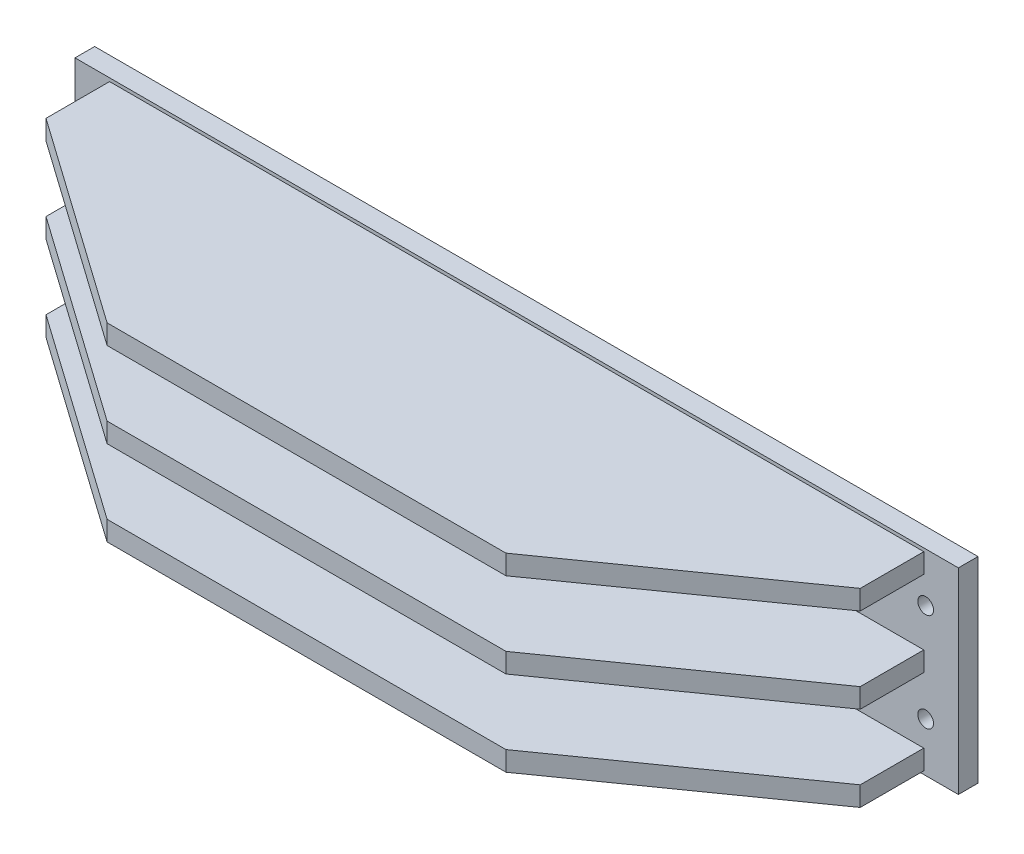
ISO-10303-21;
HEADER;
FILE_DESCRIPTION(('STEP AP214'),'2;1');
FILE_NAME('part.step','',(''),(''),'','','');
FILE_SCHEMA(('AUTOMOTIVE_DESIGN { 1 0 10303 214 1 1 1 1 }'));
ENDSEC;
DATA;
#1=APPLICATION_CONTEXT('core data for automotive mechanical design processes');
#2=APPLICATION_PROTOCOL_DEFINITION('international standard','automotive_design',2000,#1);
#3=PRODUCT_CONTEXT('',#1,'mechanical');
#4=PRODUCT('Part','Part','',(#3));
#5=PRODUCT_RELATED_PRODUCT_CATEGORY('part','',(#4));
#6=PRODUCT_DEFINITION_FORMATION('','',#4);
#7=PRODUCT_DEFINITION_CONTEXT('part definition',#1,'design');
#8=PRODUCT_DEFINITION('design','',#6,#7);
#9=PRODUCT_DEFINITION_SHAPE('','',#8);
#10=(LENGTH_UNIT() NAMED_UNIT(*) SI_UNIT(.MILLI.,.METRE.));
#11=(NAMED_UNIT(*) PLANE_ANGLE_UNIT() SI_UNIT($,.RADIAN.));
#12=(NAMED_UNIT(*) SI_UNIT($,.STERADIAN.) SOLID_ANGLE_UNIT());
#13=UNCERTAINTY_MEASURE_WITH_UNIT(LENGTH_MEASURE(1.E-05),#10,'distance_accuracy_value','');
#14=(GEOMETRIC_REPRESENTATION_CONTEXT(3) GLOBAL_UNCERTAINTY_ASSIGNED_CONTEXT((#13)) GLOBAL_UNIT_ASSIGNED_CONTEXT((#10,
#11,#12)) REPRESENTATION_CONTEXT('',''));
#15=CARTESIAN_POINT('',(0.,0.,0.));
#16=DIRECTION('',(0.,0.,1.));
#17=DIRECTION('',(1.,0.,0.));
#18=AXIS2_PLACEMENT_3D('',#15,#16,#17);
#19=CARTESIAN_POINT('',(-624.660738317164,-200.554392857748,30.));
#20=DIRECTION('',(1.,0.,0.));
#21=DIRECTION('',(0.,0.,-1.));
#22=AXIS2_PLACEMENT_3D('',#19,#20,#21);
#23=PLANE('',#22);
#24=DIRECTION('',(0.,-1.,0.));
#25=VECTOR('',#24,1.);
#26=CARTESIAN_POINT('',(-624.660738317164,-200.554392857748,0.));
#27=LINE('',#26,#25);
#28=CARTESIAN_POINT('',(-624.660738317164,99.4456071422519,0.));
#29=VERTEX_POINT('',#28);
#30=CARTESIAN_POINT('',(-624.660738317164,-200.554392857748,0.));
#31=VERTEX_POINT('',#30);
#32=EDGE_CURVE('E328',#29,#31,#27,.T.);
#33=ORIENTED_EDGE('',*,*,#32,.T.);
#34=DIRECTION('',(0.,0.,-1.));
#35=VECTOR('',#34,1.);
#36=CARTESIAN_POINT('',(-624.660738317164,-200.554392857748,30.));
#37=LINE('',#36,#35);
#38=CARTESIAN_POINT('',(-624.660738317164,-200.554392857748,30.));
#39=VERTEX_POINT('',#38);
#40=EDGE_CURVE('E11',#39,#31,#37,.T.);
#41=ORIENTED_EDGE('',*,*,#40,.F.);
#42=DIRECTION('',(0.,-1.,0.));
#43=VECTOR('',#42,1.);
#44=CARTESIAN_POINT('',(-624.660738317164,-200.554392857748,30.));
#45=LINE('',#44,#43);
#46=CARTESIAN_POINT('',(-624.660738317164,99.4456071422519,30.));
#47=VERTEX_POINT('',#46);
#48=EDGE_CURVE('E331',#47,#39,#45,.T.);
#49=ORIENTED_EDGE('',*,*,#48,.F.);
#50=DIRECTION('',(0.,0.,-1.));
#51=VECTOR('',#50,1.);
#52=CARTESIAN_POINT('',(-624.660738317164,99.4456071422519,30.));
#53=LINE('',#52,#51);
#54=EDGE_CURVE('E341',#47,#29,#53,.T.);
#55=ORIENTED_EDGE('',*,*,#54,.T.);
#56=EDGE_LOOP('',(#33,#41,#49,#55));
#57=FACE_BOUND('',#56,.T.);
#58=ADVANCED_FACE('F30',(#57),#23,.F.);
#59=CARTESIAN_POINT('',(725.339261682836,-200.554392857748,30.));
#60=DIRECTION('',(0.,1.,0.));
#61=DIRECTION('',(0.,0.,1.));
#62=AXIS2_PLACEMENT_3D('',#59,#60,#61);
#63=PLANE('',#62);
#64=DIRECTION('',(1.,0.,0.));
#65=VECTOR('',#64,1.);
#66=CARTESIAN_POINT('',(725.339261682836,-200.554392857748,0.));
#67=LINE('',#66,#65);
#68=CARTESIAN_POINT('',(725.339261682836,-200.554392857748,0.));
#69=VERTEX_POINT('',#68);
#70=EDGE_CURVE('E344',#31,#69,#67,.T.);
#71=ORIENTED_EDGE('',*,*,#70,.T.);
#72=DIRECTION('',(0.,0.,-1.));
#73=VECTOR('',#72,1.);
#74=CARTESIAN_POINT('',(725.339261682836,-200.554392857748,30.));
#75=LINE('',#74,#73);
#76=CARTESIAN_POINT('',(725.339261682836,-200.554392857748,30.));
#77=VERTEX_POINT('',#76);
#78=EDGE_CURVE('E37',#77,#69,#75,.T.);
#79=ORIENTED_EDGE('',*,*,#78,.F.);
#80=DIRECTION('',(1.,0.,0.));
#81=VECTOR('',#80,1.);
#82=CARTESIAN_POINT('',(725.339261682836,-200.554392857748,30.));
#83=LINE('',#82,#81);
#84=EDGE_CURVE('E334',#39,#77,#83,.T.);
#85=ORIENTED_EDGE('',*,*,#84,.F.);
#86=ORIENTED_EDGE('',*,*,#40,.T.);
#87=EDGE_LOOP('',(#71,#79,#85,#86));
#88=FACE_BOUND('',#87,.T.);
#89=ADVANCED_FACE('F373',(#88),#63,.F.);
#90=CARTESIAN_POINT('',(725.339261682836,-200.554392857748,30.));
#91=DIRECTION('',(-1.,0.,0.));
#92=DIRECTION('',(0.,0.,1.));
#93=AXIS2_PLACEMENT_3D('',#90,#91,#92);
#94=PLANE('',#93);
#95=DIRECTION('',(0.,1.,0.));
#96=VECTOR('',#95,1.);
#97=CARTESIAN_POINT('',(725.339261682836,-200.554392857748,0.));
#98=LINE('',#97,#96);
#99=CARTESIAN_POINT('',(725.339261682836,99.4456071422519,0.));
#100=VERTEX_POINT('',#99);
#101=EDGE_CURVE('E346',#69,#100,#98,.T.);
#102=ORIENTED_EDGE('',*,*,#101,.T.);
#103=DIRECTION('',(0.,0.,-1.));
#104=VECTOR('',#103,1.);
#105=CARTESIAN_POINT('',(725.339261682836,99.4456071422519,30.));
#106=LINE('',#105,#104);
#107=CARTESIAN_POINT('',(725.339261682836,99.4456071422519,30.));
#108=VERTEX_POINT('',#107);
#109=EDGE_CURVE('E351',#108,#100,#106,.T.);
#110=ORIENTED_EDGE('',*,*,#109,.F.);
#111=DIRECTION('',(0.,1.,0.));
#112=VECTOR('',#111,1.);
#113=CARTESIAN_POINT('',(725.339261682836,-200.554392857748,30.));
#114=LINE('',#113,#112);
#115=EDGE_CURVE('E337',#77,#108,#114,.T.);
#116=ORIENTED_EDGE('',*,*,#115,.F.);
#117=ORIENTED_EDGE('',*,*,#78,.T.);
#118=EDGE_LOOP('',(#102,#110,#116,#117));
#119=FACE_BOUND('',#118,.T.);
#120=ADVANCED_FACE('F358',(#119),#94,.F.);
#121=CARTESIAN_POINT('',(725.339261682836,99.4456071422519,30.));
#122=DIRECTION('',(0.,-1.,0.));
#123=DIRECTION('',(0.,0.,-1.));
#124=AXIS2_PLACEMENT_3D('',#121,#122,#123);
#125=PLANE('',#124);
#126=DIRECTION('',(-1.,0.,0.));
#127=VECTOR('',#126,1.);
#128=CARTESIAN_POINT('',(725.339261682836,99.4456071422519,0.));
#129=LINE('',#128,#127);
#130=EDGE_CURVE('E335',#100,#29,#129,.T.);
#131=ORIENTED_EDGE('',*,*,#130,.T.);
#132=ORIENTED_EDGE('',*,*,#54,.F.);
#133=DIRECTION('',(-1.,0.,0.));
#134=VECTOR('',#133,1.);
#135=CARTESIAN_POINT('',(725.339261682836,99.4456071422519,30.));
#136=LINE('',#135,#134);
#137=EDGE_CURVE('E339',#108,#47,#136,.T.);
#138=ORIENTED_EDGE('',*,*,#137,.F.);
#139=ORIENTED_EDGE('',*,*,#109,.T.);
#140=EDGE_LOOP('',(#131,#132,#138,#139));
#141=FACE_BOUND('',#140,.T.);
#142=ADVANCED_FACE('F367',(#141),#125,.F.);
#143=CARTESIAN_POINT('',(-624.660738317164,99.4456071422519,30.));
#144=DIRECTION('',(0.,0.,1.));
#145=DIRECTION('',(1.,0.,0.));
#146=AXIS2_PLACEMENT_3D('',#143,#144,#145);
#147=PLANE('',#146);
#148=DIRECTION('',(1.,0.,0.));
#149=VECTOR('',#148,1.);
#150=CARTESIAN_POINT('',(672.504361407834,-165.554392857748,30.));
#151=LINE('',#150,#149);
#152=CARTESIAN_POINT('',(-571.825838042161,-165.554392857748,30.));
#153=VERTEX_POINT('',#152);
#154=CARTESIAN_POINT('',(672.504361407834,-165.554392857748,30.));
#155=VERTEX_POINT('',#154);
#156=EDGE_CURVE('E201',#153,#155,#151,.T.);
#157=ORIENTED_EDGE('',*,*,#156,.T.);
#158=DIRECTION('',(0.,-1.,0.));
#159=VECTOR('',#158,1.);
#160=CARTESIAN_POINT('',(672.504361407834,-165.554392857748,30.));
#161=LINE('',#160,#159);
#162=CARTESIAN_POINT('',(672.504361407834,-195.554392857748,30.));
#163=VERTEX_POINT('',#162);
#164=EDGE_CURVE('E185',#155,#163,#161,.T.);
#165=ORIENTED_EDGE('',*,*,#164,.T.);
#166=DIRECTION('',(1.,0.,0.));
#167=VECTOR('',#166,1.);
#168=CARTESIAN_POINT('',(672.504361407834,-195.554392857748,30.));
#169=LINE('',#168,#167);
#170=CARTESIAN_POINT('',(-571.825838042161,-195.554392857748,30.));
#171=VERTEX_POINT('',#170);
#172=EDGE_CURVE('E191',#171,#163,#169,.T.);
#173=ORIENTED_EDGE('',*,*,#172,.F.);
#174=DIRECTION('',(0.,-1.,0.));
#175=VECTOR('',#174,1.);
#176=CARTESIAN_POINT('',(-571.825838042161,-165.554392857748,30.));
#177=LINE('',#176,#175);
#178=EDGE_CURVE('E214',#153,#171,#177,.T.);
#179=ORIENTED_EDGE('',*,*,#178,.F.);
#180=EDGE_LOOP('',(#157,#165,#173,#179));
#181=FACE_BOUND('',#180,.T.);
#182=DIRECTION('',(1.,0.,0.));
#183=VECTOR('',#182,1.);
#184=CARTESIAN_POINT('',(672.504361407834,94.4456071422519,30.));
#185=LINE('',#184,#183);
#186=CARTESIAN_POINT('',(-571.825838042161,94.4456071422519,30.));
#187=VERTEX_POINT('',#186);
#188=CARTESIAN_POINT('',(672.504361407834,94.4456071422519,30.));
#189=VERTEX_POINT('',#188);
#190=EDGE_CURVE('E226',#187,#189,#185,.T.);
#191=ORIENTED_EDGE('',*,*,#190,.T.);
#192=DIRECTION('',(0.,-1.,0.));
#193=VECTOR('',#192,1.);
#194=CARTESIAN_POINT('',(672.504361407834,94.4456071422519,30.));
#195=LINE('',#194,#193);
#196=CARTESIAN_POINT('',(672.504361407834,64.4456071422519,30.));
#197=VERTEX_POINT('',#196);
#198=EDGE_CURVE('E244',#189,#197,#195,.T.);
#199=ORIENTED_EDGE('',*,*,#198,.T.);
#200=DIRECTION('',(1.,0.,0.));
#201=VECTOR('',#200,1.);
#202=CARTESIAN_POINT('',(672.504361407834,64.4456071422519,30.));
#203=LINE('',#202,#201);
#204=CARTESIAN_POINT('',(-571.825838042161,64.4456071422519,30.));
#205=VERTEX_POINT('',#204);
#206=EDGE_CURVE('E211',#205,#197,#203,.T.);
#207=ORIENTED_EDGE('',*,*,#206,.F.);
#208=DIRECTION('',(0.,-1.,0.));
#209=VECTOR('',#208,1.);
#210=CARTESIAN_POINT('',(-571.825838042161,94.4456071422519,30.));
#211=LINE('',#210,#209);
#212=EDGE_CURVE('E245',#187,#205,#211,.T.);
#213=ORIENTED_EDGE('',*,*,#212,.F.);
#214=EDGE_LOOP('',(#191,#199,#207,#213));
#215=FACE_BOUND('',#214,.T.);
#216=DIRECTION('',(1.,0.,0.));
#217=VECTOR('',#216,1.);
#218=CARTESIAN_POINT('',(672.504361407834,-35.5543928577481,30.));
#219=LINE('',#218,#217);
#220=CARTESIAN_POINT('',(-571.825838042161,-35.5543928577481,30.));
#221=VERTEX_POINT('',#220);
#222=CARTESIAN_POINT('',(672.504361407834,-35.5543928577481,30.));
#223=VERTEX_POINT('',#222);
#224=EDGE_CURVE('E274',#221,#223,#219,.T.);
#225=ORIENTED_EDGE('',*,*,#224,.T.);
#226=DIRECTION('',(0.,-1.,0.));
#227=VECTOR('',#226,1.);
#228=CARTESIAN_POINT('',(672.504361407834,-35.5543928577481,30.));
#229=LINE('',#228,#227);
#230=CARTESIAN_POINT('',(672.504361407834,-65.5543928577481,30.));
#231=VERTEX_POINT('',#230);
#232=EDGE_CURVE('E292',#223,#231,#229,.T.);
#233=ORIENTED_EDGE('',*,*,#232,.T.);
#234=DIRECTION('',(1.,0.,0.));
#235=VECTOR('',#234,1.);
#236=CARTESIAN_POINT('',(672.504361407834,-65.5543928577481,30.));
#237=LINE('',#236,#235);
#238=CARTESIAN_POINT('',(-571.825838042161,-65.5543928577481,30.));
#239=VERTEX_POINT('',#238);
#240=EDGE_CURVE('E247',#239,#231,#237,.T.);
#241=ORIENTED_EDGE('',*,*,#240,.F.);
#242=DIRECTION('',(0.,-1.,0.));
#243=VECTOR('',#242,1.);
#244=CARTESIAN_POINT('',(-571.825838042161,-35.5543928577481,30.));
#245=LINE('',#244,#243);
#246=EDGE_CURVE('E293',#221,#239,#245,.T.);
#247=ORIENTED_EDGE('',*,*,#246,.F.);
#248=EDGE_LOOP('',(#225,#233,#241,#247));
#249=FACE_BOUND('',#248,.T.);
#250=CARTESIAN_POINT('',(-574.660738317164,24.445607142252,30.));
#251=DIRECTION('',(0.,0.,1.));
#252=DIRECTION('',(-1.,0.,0.));
#253=AXIS2_PLACEMENT_3D('',#250,#251,#252);
#254=CIRCLE('',#253,12.);
#255=CARTESIAN_POINT('',(-586.660738317164,24.445607142252,30.));
#256=VERTEX_POINT('',#255);
#257=EDGE_CURVE('E296',#256,#256,#254,.T.);
#258=ORIENTED_EDGE('',*,*,#257,.F.);
#259=EDGE_LOOP('',(#258));
#260=FACE_BOUND('',#259,.T.);
#261=CARTESIAN_POINT('',(-574.660738317164,-125.554392857748,30.));
#262=DIRECTION('',(0.,0.,1.));
#263=DIRECTION('',(-1.,0.,0.));
#264=AXIS2_PLACEMENT_3D('',#261,#262,#263);
#265=CIRCLE('',#264,12.);
#266=CARTESIAN_POINT('',(-586.660738317164,-125.554392857748,30.));
#267=VERTEX_POINT('',#266);
#268=EDGE_CURVE('E310',#267,#267,#265,.T.);
#269=ORIENTED_EDGE('',*,*,#268,.F.);
#270=EDGE_LOOP('',(#269));
#271=FACE_BOUND('',#270,.T.);
#272=CARTESIAN_POINT('',(675.339261682836,-125.554392857748,30.));
#273=DIRECTION('',(0.,0.,1.));
#274=DIRECTION('',(1.,0.,0.));
#275=AXIS2_PLACEMENT_3D('',#272,#273,#274);
#276=CIRCLE('',#275,12.);
#277=CARTESIAN_POINT('',(687.339261682836,-125.554392857748,30.));
#278=VERTEX_POINT('',#277);
#279=EDGE_CURVE('E316',#278,#278,#276,.T.);
#280=ORIENTED_EDGE('',*,*,#279,.F.);
#281=EDGE_LOOP('',(#280));
#282=FACE_BOUND('',#281,.T.);
#283=CARTESIAN_POINT('',(675.339261682836,24.445607142252,30.));
#284=DIRECTION('',(0.,0.,1.));
#285=DIRECTION('',(1.,0.,0.));
#286=AXIS2_PLACEMENT_3D('',#283,#284,#285);
#287=CIRCLE('',#286,12.);
#288=CARTESIAN_POINT('',(687.339261682836,24.445607142252,30.));
#289=VERTEX_POINT('',#288);
#290=EDGE_CURVE('E322',#289,#289,#287,.T.);
#291=ORIENTED_EDGE('',*,*,#290,.F.);
#292=EDGE_LOOP('',(#291));
#293=FACE_BOUND('',#292,.T.);
#294=ORIENTED_EDGE('',*,*,#48,.T.);
#295=ORIENTED_EDGE('',*,*,#84,.T.);
#296=ORIENTED_EDGE('',*,*,#115,.T.);
#297=ORIENTED_EDGE('',*,*,#137,.T.);
#298=EDGE_LOOP('',(#294,#295,#296,#297));
#299=FACE_BOUND('',#298,.T.);
#300=ADVANCED_FACE('F199',(#181,#215,#249,#260,#271,#282,#293,#299),#147,.T.);
#301=CARTESIAN_POINT('',(-624.660738317164,99.4456071422519,0.));
#302=DIRECTION('',(0.,0.,1.));
#303=DIRECTION('',(1.,0.,0.));
#304=AXIS2_PLACEMENT_3D('',#301,#302,#303);
#305=PLANE('',#304);
#306=CARTESIAN_POINT('',(-574.660738317164,24.445607142252,0.));
#307=DIRECTION('',(0.,0.,1.));
#308=DIRECTION('',(-1.,0.,0.));
#309=AXIS2_PLACEMENT_3D('',#306,#307,#308);
#310=CIRCLE('',#309,12.);
#311=CARTESIAN_POINT('',(-586.660738317164,24.445607142252,0.));
#312=VERTEX_POINT('',#311);
#313=EDGE_CURVE('E307',#312,#312,#310,.T.);
#314=ORIENTED_EDGE('',*,*,#313,.T.);
#315=EDGE_LOOP('',(#314));
#316=FACE_BOUND('',#315,.T.);
#317=CARTESIAN_POINT('',(-574.660738317164,-125.554392857748,0.));
#318=DIRECTION('',(0.,0.,1.));
#319=DIRECTION('',(-1.,0.,0.));
#320=AXIS2_PLACEMENT_3D('',#317,#318,#319);
#321=CIRCLE('',#320,12.);
#322=CARTESIAN_POINT('',(-586.660738317164,-125.554392857748,0.));
#323=VERTEX_POINT('',#322);
#324=EDGE_CURVE('E313',#323,#323,#321,.T.);
#325=ORIENTED_EDGE('',*,*,#324,.T.);
#326=EDGE_LOOP('',(#325));
#327=FACE_BOUND('',#326,.T.);
#328=CARTESIAN_POINT('',(675.339261682836,-125.554392857748,0.));
#329=DIRECTION('',(0.,0.,1.));
#330=DIRECTION('',(1.,0.,0.));
#331=AXIS2_PLACEMENT_3D('',#328,#329,#330);
#332=CIRCLE('',#331,12.);
#333=CARTESIAN_POINT('',(687.339261682836,-125.554392857748,0.));
#334=VERTEX_POINT('',#333);
#335=EDGE_CURVE('E319',#334,#334,#332,.T.);
#336=ORIENTED_EDGE('',*,*,#335,.T.);
#337=EDGE_LOOP('',(#336));
#338=FACE_BOUND('',#337,.T.);
#339=CARTESIAN_POINT('',(675.339261682836,24.445607142252,0.));
#340=DIRECTION('',(0.,0.,1.));
#341=DIRECTION('',(1.,0.,0.));
#342=AXIS2_PLACEMENT_3D('',#339,#340,#341);
#343=CIRCLE('',#342,12.);
#344=CARTESIAN_POINT('',(687.339261682836,24.445607142252,0.));
#345=VERTEX_POINT('',#344);
#346=EDGE_CURVE('E325',#345,#345,#343,.T.);
#347=ORIENTED_EDGE('',*,*,#346,.T.);
#348=EDGE_LOOP('',(#347));
#349=FACE_BOUND('',#348,.T.);
#350=ORIENTED_EDGE('',*,*,#32,.F.);
#351=ORIENTED_EDGE('',*,*,#130,.F.);
#352=ORIENTED_EDGE('',*,*,#101,.F.);
#353=ORIENTED_EDGE('',*,*,#70,.F.);
#354=EDGE_LOOP('',(#350,#351,#352,#353));
#355=FACE_BOUND('',#354,.T.);
#356=ADVANCED_FACE('F364',(#316,#327,#338,#349,#355),#305,.F.);
#357=CARTESIAN_POINT('',(675.339261682836,24.445607142252,0.));
#358=DIRECTION('',(0.,0.,1.));
#359=DIRECTION('',(1.,0.,0.));
#360=AXIS2_PLACEMENT_3D('',#357,#358,#359);
#361=CYLINDRICAL_SURFACE('',#360,12.);
#362=ORIENTED_EDGE('',*,*,#346,.F.);
#363=EDGE_LOOP('',(#362));
#364=FACE_BOUND('',#363,.T.);
#365=ORIENTED_EDGE('',*,*,#290,.T.);
#366=EDGE_LOOP('',(#365));
#367=FACE_BOUND('',#366,.T.);
#368=ADVANCED_FACE('F385',(#364,#367),#361,.F.);
#369=CARTESIAN_POINT('',(675.339261682836,-125.554392857748,0.));
#370=DIRECTION('',(0.,0.,1.));
#371=DIRECTION('',(1.,0.,0.));
#372=AXIS2_PLACEMENT_3D('',#369,#370,#371);
#373=CYLINDRICAL_SURFACE('',#372,12.);
#374=ORIENTED_EDGE('',*,*,#335,.F.);
#375=EDGE_LOOP('',(#374));
#376=FACE_BOUND('',#375,.T.);
#377=ORIENTED_EDGE('',*,*,#279,.T.);
#378=EDGE_LOOP('',(#377));
#379=FACE_BOUND('',#378,.T.);
#380=ADVANCED_FACE('F391',(#376,#379),#373,.F.);
#381=CARTESIAN_POINT('',(-574.660738317164,-125.554392857748,0.));
#382=DIRECTION('',(0.,0.,1.));
#383=DIRECTION('',(1.,0.,0.));
#384=AXIS2_PLACEMENT_3D('',#381,#382,#383);
#385=CYLINDRICAL_SURFACE('',#384,12.);
#386=ORIENTED_EDGE('',*,*,#324,.F.);
#387=EDGE_LOOP('',(#386));
#388=FACE_BOUND('',#387,.T.);
#389=ORIENTED_EDGE('',*,*,#268,.T.);
#390=EDGE_LOOP('',(#389));
#391=FACE_BOUND('',#390,.T.);
#392=ADVANCED_FACE('F395',(#388,#391),#385,.F.);
#393=CARTESIAN_POINT('',(-574.660738317164,24.445607142252,0.));
#394=DIRECTION('',(0.,0.,1.));
#395=DIRECTION('',(1.,0.,0.));
#396=AXIS2_PLACEMENT_3D('',#393,#394,#395);
#397=CYLINDRICAL_SURFACE('',#396,12.);
#398=ORIENTED_EDGE('',*,*,#313,.F.);
#399=EDGE_LOOP('',(#398));
#400=FACE_BOUND('',#399,.T.);
#401=ORIENTED_EDGE('',*,*,#257,.T.);
#402=EDGE_LOOP('',(#401));
#403=FACE_BOUND('',#402,.T.);
#404=ADVANCED_FACE('F399',(#400,#403),#397,.F.);
#405=CARTESIAN_POINT('',(-571.825838042161,-35.5543928577481,30.));
#406=DIRECTION('',(-1.,0.,0.));
#407=DIRECTION('',(0.,0.,1.));
#408=AXIS2_PLACEMENT_3D('',#405,#406,#407);
#409=PLANE('',#408);
#410=ORIENTED_EDGE('',*,*,#246,.T.);
#411=DIRECTION('',(0.,0.,-1.));
#412=VECTOR('',#411,1.);
#413=CARTESIAN_POINT('',(-571.825838042161,-65.5543928577481,30.));
#414=LINE('',#413,#412);
#415=CARTESIAN_POINT('',(-571.825838042161,-65.5543928577481,127.167276949804));
#416=VERTEX_POINT('',#415);
#417=EDGE_CURVE('E272',#416,#239,#414,.T.);
#418=ORIENTED_EDGE('',*,*,#417,.F.);
#419=DIRECTION('',(0.,-1.,0.));
#420=VECTOR('',#419,1.);
#421=CARTESIAN_POINT('',(-571.825838042161,-35.5543928577481,127.167276949804));
#422=LINE('',#421,#420);
#423=CARTESIAN_POINT('',(-571.825838042161,-35.5543928577481,127.167276949804));
#424=VERTEX_POINT('',#423);
#425=EDGE_CURVE('E297',#424,#416,#422,.T.);
#426=ORIENTED_EDGE('',*,*,#425,.F.);
#427=DIRECTION('',(0.,0.,-1.));
#428=VECTOR('',#427,1.);
#429=CARTESIAN_POINT('',(-571.825838042161,-35.5543928577481,30.));
#430=LINE('',#429,#428);
#431=EDGE_CURVE('E289',#424,#221,#430,.T.);
#432=ORIENTED_EDGE('',*,*,#431,.T.);
#433=EDGE_LOOP('',(#410,#418,#426,#432));
#434=FACE_BOUND('',#433,.T.);
#435=ADVANCED_FACE('F403',(#434),#409,.T.);
#436=CARTESIAN_POINT('',(-571.825838042161,-35.5543928577481,127.167276949804));
#437=DIRECTION('',(-0.576683697426473,0.,0.816967510444897));
#438=DIRECTION('',(0.816967510444897,0.,0.576683697426473));
#439=AXIS2_PLACEMENT_3D('',#436,#437,#438);
#440=PLANE('',#439);
#441=ORIENTED_EDGE('',*,*,#425,.T.);
#442=DIRECTION('',(-0.816967510444897,0.,-0.576683697426473));
#443=VECTOR('',#442,1.);
#444=CARTESIAN_POINT('',(-571.825838042161,-65.5543928577481,127.167276949804));
#445=LINE('',#444,#443);
#446=CARTESIAN_POINT('',(-254.460738317164,-65.5543928577481,351.189991199317));
#447=VERTEX_POINT('',#446);
#448=EDGE_CURVE('E269',#447,#416,#445,.T.);
#449=ORIENTED_EDGE('',*,*,#448,.F.);
#450=DIRECTION('',(0.,-1.,0.));
#451=VECTOR('',#450,1.);
#452=CARTESIAN_POINT('',(-254.460738317164,-35.5543928577481,351.189991199317));
#453=LINE('',#452,#451);
#454=CARTESIAN_POINT('',(-254.460738317164,-35.5543928577481,351.189991199317));
#455=VERTEX_POINT('',#454);
#456=EDGE_CURVE('E299',#455,#447,#453,.T.);
#457=ORIENTED_EDGE('',*,*,#456,.F.);
#458=DIRECTION('',(-0.816967510444897,0.,-0.576683697426473));
#459=VECTOR('',#458,1.);
#460=CARTESIAN_POINT('',(-571.825838042161,-35.5543928577481,127.167276949804));
#461=LINE('',#460,#459);
#462=EDGE_CURVE('E286',#455,#424,#461,.T.);
#463=ORIENTED_EDGE('',*,*,#462,.T.);
#464=EDGE_LOOP('',(#441,#449,#457,#463));
#465=FACE_BOUND('',#464,.T.);
#466=ADVANCED_FACE('F417',(#465),#440,.T.);
#467=CARTESIAN_POINT('',(-254.460738317164,-35.5543928577481,351.189991199317));
#468=DIRECTION('',(0.,0.,1.));
#469=DIRECTION('',(1.,0.,0.));
#470=AXIS2_PLACEMENT_3D('',#467,#468,#469);
#471=PLANE('',#470);
#472=ORIENTED_EDGE('',*,*,#456,.T.);
#473=DIRECTION('',(-1.,0.,0.));
#474=VECTOR('',#473,1.);
#475=CARTESIAN_POINT('',(-254.460738317164,-65.5543928577481,351.189991199317));
#476=LINE('',#475,#474);
#477=CARTESIAN_POINT('',(355.139261682836,-65.5543928577481,351.189991199317));
#478=VERTEX_POINT('',#477);
#479=EDGE_CURVE('E266',#478,#447,#476,.T.);
#480=ORIENTED_EDGE('',*,*,#479,.F.);
#481=DIRECTION('',(0.,-1.,0.));
#482=VECTOR('',#481,1.);
#483=CARTESIAN_POINT('',(355.139261682836,-35.5543928577481,351.189991199317));
#484=LINE('',#483,#482);
#485=CARTESIAN_POINT('',(355.139261682836,-35.5543928577481,351.189991199317));
#486=VERTEX_POINT('',#485);
#487=EDGE_CURVE('E301',#486,#478,#484,.T.);
#488=ORIENTED_EDGE('',*,*,#487,.F.);
#489=DIRECTION('',(-1.,0.,0.));
#490=VECTOR('',#489,1.);
#491=CARTESIAN_POINT('',(-254.460738317164,-35.5543928577481,351.189991199317));
#492=LINE('',#491,#490);
#493=EDGE_CURVE('E283',#486,#455,#492,.T.);
#494=ORIENTED_EDGE('',*,*,#493,.T.);
#495=EDGE_LOOP('',(#472,#480,#488,#494));
#496=FACE_BOUND('',#495,.T.);
#497=ADVANCED_FACE('F413',(#496),#471,.T.);
#498=CARTESIAN_POINT('',(672.504361407834,-35.5543928577481,127.167276949804));
#499=DIRECTION('',(0.576683697426473,0.,0.816967510444897));
#500=DIRECTION('',(0.816967510444897,0.,-0.576683697426473));
#501=AXIS2_PLACEMENT_3D('',#498,#499,#500);
#502=PLANE('',#501);
#503=ORIENTED_EDGE('',*,*,#487,.T.);
#504=DIRECTION('',(-0.816967510444897,0.,0.576683697426473));
#505=VECTOR('',#504,1.);
#506=CARTESIAN_POINT('',(672.504361407834,-65.5543928577481,127.167276949804));
#507=LINE('',#506,#505);
#508=CARTESIAN_POINT('',(672.504361407834,-65.5543928577481,127.167276949804));
#509=VERTEX_POINT('',#508);
#510=EDGE_CURVE('E263',#509,#478,#507,.T.);
#511=ORIENTED_EDGE('',*,*,#510,.F.);
#512=DIRECTION('',(0.,-1.,0.));
#513=VECTOR('',#512,1.);
#514=CARTESIAN_POINT('',(672.504361407834,-35.5543928577481,127.167276949804));
#515=LINE('',#514,#513);
#516=CARTESIAN_POINT('',(672.504361407834,-35.5543928577481,127.167276949804));
#517=VERTEX_POINT('',#516);
#518=EDGE_CURVE('E303',#517,#509,#515,.T.);
#519=ORIENTED_EDGE('',*,*,#518,.F.);
#520=DIRECTION('',(-0.816967510444897,0.,0.576683697426473));
#521=VECTOR('',#520,1.);
#522=CARTESIAN_POINT('',(672.504361407834,-35.5543928577481,127.167276949804));
#523=LINE('',#522,#521);
#524=EDGE_CURVE('E280',#517,#486,#523,.T.);
#525=ORIENTED_EDGE('',*,*,#524,.T.);
#526=EDGE_LOOP('',(#503,#511,#519,#525));
#527=FACE_BOUND('',#526,.T.);
#528=ADVANCED_FACE('F409',(#527),#502,.T.);
#529=CARTESIAN_POINT('',(672.504361407834,-35.5543928577481,30.));
#530=DIRECTION('',(1.,0.,0.));
#531=DIRECTION('',(0.,0.,-1.));
#532=AXIS2_PLACEMENT_3D('',#529,#530,#531);
#533=PLANE('',#532);
#534=ORIENTED_EDGE('',*,*,#518,.T.);
#535=DIRECTION('',(0.,0.,1.));
#536=VECTOR('',#535,1.);
#537=CARTESIAN_POINT('',(672.504361407834,-65.5543928577481,30.));
#538=LINE('',#537,#536);
#539=EDGE_CURVE('E260',#231,#509,#538,.T.);
#540=ORIENTED_EDGE('',*,*,#539,.F.);
#541=ORIENTED_EDGE('',*,*,#232,.F.);
#542=DIRECTION('',(0.,0.,1.));
#543=VECTOR('',#542,1.);
#544=CARTESIAN_POINT('',(672.504361407834,-35.5543928577481,30.));
#545=LINE('',#544,#543);
#546=EDGE_CURVE('E277',#223,#517,#545,.T.);
#547=ORIENTED_EDGE('',*,*,#546,.T.);
#548=EDGE_LOOP('',(#534,#540,#541,#547));
#549=FACE_BOUND('',#548,.T.);
#550=ADVANCED_FACE('F405',(#549),#533,.T.);
#551=CARTESIAN_POINT('',(-571.825838042161,-35.5543928577481,30.));
#552=DIRECTION('',(0.,1.,0.));
#553=DIRECTION('',(0.,0.,1.));
#554=AXIS2_PLACEMENT_3D('',#551,#552,#553);
#555=PLANE('',#554);
#556=ORIENTED_EDGE('',*,*,#224,.F.);
#557=ORIENTED_EDGE('',*,*,#431,.F.);
#558=ORIENTED_EDGE('',*,*,#462,.F.);
#559=ORIENTED_EDGE('',*,*,#493,.F.);
#560=ORIENTED_EDGE('',*,*,#524,.F.);
#561=ORIENTED_EDGE('',*,*,#546,.F.);
#562=EDGE_LOOP('',(#556,#557,#558,#559,#560,#561));
#563=FACE_BOUND('',#562,.T.);
#564=ADVANCED_FACE('F408',(#563),#555,.T.);
#565=CARTESIAN_POINT('',(-571.825838042161,-65.5543928577481,30.));
#566=DIRECTION('',(0.,1.,0.));
#567=DIRECTION('',(0.,0.,1.));
#568=AXIS2_PLACEMENT_3D('',#565,#566,#567);
#569=PLANE('',#568);
#570=ORIENTED_EDGE('',*,*,#240,.T.);
#571=ORIENTED_EDGE('',*,*,#539,.T.);
#572=ORIENTED_EDGE('',*,*,#510,.T.);
#573=ORIENTED_EDGE('',*,*,#479,.T.);
#574=ORIENTED_EDGE('',*,*,#448,.T.);
#575=ORIENTED_EDGE('',*,*,#417,.T.);
#576=EDGE_LOOP('',(#570,#571,#572,#573,#574,#575));
#577=FACE_BOUND('',#576,.T.);
#578=ADVANCED_FACE('F427',(#577),#569,.F.);
#579=CARTESIAN_POINT('',(-571.825838042161,94.4456071422519,30.));
#580=DIRECTION('',(-1.,0.,0.));
#581=DIRECTION('',(0.,0.,1.));
#582=AXIS2_PLACEMENT_3D('',#579,#580,#581);
#583=PLANE('',#582);
#584=ORIENTED_EDGE('',*,*,#212,.T.);
#585=DIRECTION('',(0.,0.,-1.));
#586=VECTOR('',#585,1.);
#587=CARTESIAN_POINT('',(-571.825838042161,64.4456071422519,30.));
#588=LINE('',#587,#586);
#589=CARTESIAN_POINT('',(-571.825838042161,64.4456071422519,127.167276949804));
#590=VERTEX_POINT('',#589);
#591=EDGE_CURVE('E52',#590,#205,#588,.T.);
#592=ORIENTED_EDGE('',*,*,#591,.F.);
#593=DIRECTION('',(0.,-1.,0.));
#594=VECTOR('',#593,1.);
#595=CARTESIAN_POINT('',(-571.825838042161,94.4456071422519,127.167276949804));
#596=LINE('',#595,#594);
#597=CARTESIAN_POINT('',(-571.825838042161,94.4456071422519,127.167276949804));
#598=VERTEX_POINT('',#597);
#599=EDGE_CURVE('E248',#598,#590,#596,.T.);
#600=ORIENTED_EDGE('',*,*,#599,.F.);
#601=DIRECTION('',(0.,0.,-1.));
#602=VECTOR('',#601,1.);
#603=CARTESIAN_POINT('',(-571.825838042161,94.4456071422519,30.));
#604=LINE('',#603,#602);
#605=EDGE_CURVE('E241',#598,#187,#604,.T.);
#606=ORIENTED_EDGE('',*,*,#605,.T.);
#607=EDGE_LOOP('',(#584,#592,#600,#606));
#608=FACE_BOUND('',#607,.T.);
#609=ADVANCED_FACE('F431',(#608),#583,.T.);
#610=CARTESIAN_POINT('',(-571.825838042161,94.4456071422519,127.167276949804));
#611=DIRECTION('',(-0.576683697426473,0.,0.816967510444897));
#612=DIRECTION('',(0.816967510444897,0.,0.576683697426473));
#613=AXIS2_PLACEMENT_3D('',#610,#611,#612);
#614=PLANE('',#613);
#615=ORIENTED_EDGE('',*,*,#599,.T.);
#616=DIRECTION('',(-0.816967510444897,0.,-0.576683697426473));
#617=VECTOR('',#616,1.);
#618=CARTESIAN_POINT('',(-571.825838042161,64.4456071422519,127.167276949804));
#619=LINE('',#618,#617);
#620=CARTESIAN_POINT('',(-254.460738317164,64.4456071422519,351.189991199317));
#621=VERTEX_POINT('',#620);
#622=EDGE_CURVE('E223',#621,#590,#619,.T.);
#623=ORIENTED_EDGE('',*,*,#622,.F.);
#624=DIRECTION('',(0.,-1.,0.));
#625=VECTOR('',#624,1.);
#626=CARTESIAN_POINT('',(-254.460738317164,94.4456071422519,351.189991199317));
#627=LINE('',#626,#625);
#628=CARTESIAN_POINT('',(-254.460738317164,94.4456071422519,351.189991199317));
#629=VERTEX_POINT('',#628);
#630=EDGE_CURVE('E250',#629,#621,#627,.T.);
#631=ORIENTED_EDGE('',*,*,#630,.F.);
#632=DIRECTION('',(-0.816967510444897,0.,-0.576683697426473));
#633=VECTOR('',#632,1.);
#634=CARTESIAN_POINT('',(-571.825838042161,94.4456071422519,127.167276949804));
#635=LINE('',#634,#633);
#636=EDGE_CURVE('E238',#629,#598,#635,.T.);
#637=ORIENTED_EDGE('',*,*,#636,.T.);
#638=EDGE_LOOP('',(#615,#623,#631,#637));
#639=FACE_BOUND('',#638,.T.);
#640=ADVANCED_FACE('F445',(#639),#614,.T.);
#641=CARTESIAN_POINT('',(-254.460738317164,94.4456071422519,351.189991199317));
#642=DIRECTION('',(0.,0.,1.));
#643=DIRECTION('',(1.,0.,0.));
#644=AXIS2_PLACEMENT_3D('',#641,#642,#643);
#645=PLANE('',#644);
#646=ORIENTED_EDGE('',*,*,#630,.T.);
#647=DIRECTION('',(-1.,0.,0.));
#648=VECTOR('',#647,1.);
#649=CARTESIAN_POINT('',(-254.460738317164,64.4456071422519,351.189991199317));
#650=LINE('',#649,#648);
#651=CARTESIAN_POINT('',(355.139261682836,64.4456071422519,351.189991199317));
#652=VERTEX_POINT('',#651);
#653=EDGE_CURVE('E220',#652,#621,#650,.T.);
#654=ORIENTED_EDGE('',*,*,#653,.F.);
#655=DIRECTION('',(0.,-1.,0.));
#656=VECTOR('',#655,1.);
#657=CARTESIAN_POINT('',(355.139261682836,94.4456071422519,351.189991199317));
#658=LINE('',#657,#656);
#659=CARTESIAN_POINT('',(355.139261682836,94.4456071422519,351.189991199317));
#660=VERTEX_POINT('',#659);
#661=EDGE_CURVE('E252',#660,#652,#658,.T.);
#662=ORIENTED_EDGE('',*,*,#661,.F.);
#663=DIRECTION('',(-1.,0.,0.));
#664=VECTOR('',#663,1.);
#665=CARTESIAN_POINT('',(-254.460738317164,94.4456071422519,351.189991199317));
#666=LINE('',#665,#664);
#667=EDGE_CURVE('E235',#660,#629,#666,.T.);
#668=ORIENTED_EDGE('',*,*,#667,.T.);
#669=EDGE_LOOP('',(#646,#654,#662,#668));
#670=FACE_BOUND('',#669,.T.);
#671=ADVANCED_FACE('F441',(#670),#645,.T.);
#672=CARTESIAN_POINT('',(672.504361407834,94.4456071422519,127.167276949804));
#673=DIRECTION('',(0.576683697426473,0.,0.816967510444897));
#674=DIRECTION('',(0.816967510444897,0.,-0.576683697426473));
#675=AXIS2_PLACEMENT_3D('',#672,#673,#674);
#676=PLANE('',#675);
#677=ORIENTED_EDGE('',*,*,#661,.T.);
#678=DIRECTION('',(-0.816967510444897,0.,0.576683697426473));
#679=VECTOR('',#678,1.);
#680=CARTESIAN_POINT('',(672.504361407834,64.4456071422519,127.167276949804));
#681=LINE('',#680,#679);
#682=CARTESIAN_POINT('',(672.504361407834,64.4456071422519,127.167276949804));
#683=VERTEX_POINT('',#682);
#684=EDGE_CURVE('E217',#683,#652,#681,.T.);
#685=ORIENTED_EDGE('',*,*,#684,.F.);
#686=DIRECTION('',(0.,-1.,0.));
#687=VECTOR('',#686,1.);
#688=CARTESIAN_POINT('',(672.504361407834,94.4456071422519,127.167276949804));
#689=LINE('',#688,#687);
#690=CARTESIAN_POINT('',(672.504361407834,94.4456071422519,127.167276949804));
#691=VERTEX_POINT('',#690);
#692=EDGE_CURVE('E254',#691,#683,#689,.T.);
#693=ORIENTED_EDGE('',*,*,#692,.F.);
#694=DIRECTION('',(-0.816967510444897,0.,0.576683697426473));
#695=VECTOR('',#694,1.);
#696=CARTESIAN_POINT('',(672.504361407834,94.4456071422519,127.167276949804));
#697=LINE('',#696,#695);
#698=EDGE_CURVE('E232',#691,#660,#697,.T.);
#699=ORIENTED_EDGE('',*,*,#698,.T.);
#700=EDGE_LOOP('',(#677,#685,#693,#699));
#701=FACE_BOUND('',#700,.T.);
#702=ADVANCED_FACE('F437',(#701),#676,.T.);
#703=CARTESIAN_POINT('',(672.504361407834,94.4456071422519,30.));
#704=DIRECTION('',(1.,0.,0.));
#705=DIRECTION('',(0.,0.,-1.));
#706=AXIS2_PLACEMENT_3D('',#703,#704,#705);
#707=PLANE('',#706);
#708=ORIENTED_EDGE('',*,*,#692,.T.);
#709=DIRECTION('',(0.,0.,1.));
#710=VECTOR('',#709,1.);
#711=CARTESIAN_POINT('',(672.504361407834,64.4456071422519,30.));
#712=LINE('',#711,#710);
#713=EDGE_CURVE('E213',#197,#683,#712,.T.);
#714=ORIENTED_EDGE('',*,*,#713,.F.);
#715=ORIENTED_EDGE('',*,*,#198,.F.);
#716=DIRECTION('',(0.,0.,1.));
#717=VECTOR('',#716,1.);
#718=CARTESIAN_POINT('',(672.504361407834,94.4456071422519,30.));
#719=LINE('',#718,#717);
#720=EDGE_CURVE('E229',#189,#691,#719,.T.);
#721=ORIENTED_EDGE('',*,*,#720,.T.);
#722=EDGE_LOOP('',(#708,#714,#715,#721));
#723=FACE_BOUND('',#722,.T.);
#724=ADVANCED_FACE('F433',(#723),#707,.T.);
#725=CARTESIAN_POINT('',(-571.825838042161,94.4456071422519,30.));
#726=DIRECTION('',(0.,1.,0.));
#727=DIRECTION('',(0.,0.,1.));
#728=AXIS2_PLACEMENT_3D('',#725,#726,#727);
#729=PLANE('',#728);
#730=ORIENTED_EDGE('',*,*,#190,.F.);
#731=ORIENTED_EDGE('',*,*,#605,.F.);
#732=ORIENTED_EDGE('',*,*,#636,.F.);
#733=ORIENTED_EDGE('',*,*,#667,.F.);
#734=ORIENTED_EDGE('',*,*,#698,.F.);
#735=ORIENTED_EDGE('',*,*,#720,.F.);
#736=EDGE_LOOP('',(#730,#731,#732,#733,#734,#735));
#737=FACE_BOUND('',#736,.T.);
#738=ADVANCED_FACE('F436',(#737),#729,.T.);
#739=CARTESIAN_POINT('',(-571.825838042161,64.4456071422519,30.));
#740=DIRECTION('',(0.,1.,0.));
#741=DIRECTION('',(0.,0.,1.));
#742=AXIS2_PLACEMENT_3D('',#739,#740,#741);
#743=PLANE('',#742);
#744=ORIENTED_EDGE('',*,*,#206,.T.);
#745=ORIENTED_EDGE('',*,*,#713,.T.);
#746=ORIENTED_EDGE('',*,*,#684,.T.);
#747=ORIENTED_EDGE('',*,*,#653,.T.);
#748=ORIENTED_EDGE('',*,*,#622,.T.);
#749=ORIENTED_EDGE('',*,*,#591,.T.);
#750=EDGE_LOOP('',(#744,#745,#746,#747,#748,#749));
#751=FACE_BOUND('',#750,.T.);
#752=ADVANCED_FACE('F455',(#751),#743,.F.);
#753=CARTESIAN_POINT('',(-571.825838042161,-165.554392857748,30.));
#754=DIRECTION('',(-1.,0.,0.));
#755=DIRECTION('',(0.,0.,1.));
#756=AXIS2_PLACEMENT_3D('',#753,#754,#755);
#757=PLANE('',#756);
#758=ORIENTED_EDGE('',*,*,#178,.T.);
#759=DIRECTION('',(0.,0.,-1.));
#760=VECTOR('',#759,1.);
#761=CARTESIAN_POINT('',(-571.825838042161,-195.554392857748,30.));
#762=LINE('',#761,#760);
#763=CARTESIAN_POINT('',(-571.825838042161,-195.554392857748,127.167276949804));
#764=VERTEX_POINT('',#763);
#765=EDGE_CURVE('E44',#764,#171,#762,.T.);
#766=ORIENTED_EDGE('',*,*,#765,.F.);
#767=DIRECTION('',(0.,-1.,0.));
#768=VECTOR('',#767,1.);
#769=CARTESIAN_POINT('',(-571.825838042161,-165.554392857748,127.167276949804));
#770=LINE('',#769,#768);
#771=CARTESIAN_POINT('',(-571.825838042161,-165.554392857748,127.167276949804));
#772=VERTEX_POINT('',#771);
#773=EDGE_CURVE('E671',#772,#764,#770,.T.);
#774=ORIENTED_EDGE('',*,*,#773,.F.);
#775=DIRECTION('',(0.,0.,-1.));
#776=VECTOR('',#775,1.);
#777=CARTESIAN_POINT('',(-571.825838042161,-165.554392857748,30.));
#778=LINE('',#777,#776);
#779=EDGE_CURVE('E202',#772,#153,#778,.T.);
#780=ORIENTED_EDGE('',*,*,#779,.T.);
#781=EDGE_LOOP('',(#758,#766,#774,#780));
#782=FACE_BOUND('',#781,.T.);
#783=ADVANCED_FACE('F459',(#782),#757,.T.);
#784=CARTESIAN_POINT('',(-571.825838042161,-165.554392857748,127.167276949804));
#785=DIRECTION('',(-0.576683697426473,0.,0.816967510444897));
#786=DIRECTION('',(0.816967510444897,0.,0.576683697426473));
#787=AXIS2_PLACEMENT_3D('',#784,#785,#786);
#788=PLANE('',#787);
#789=ORIENTED_EDGE('',*,*,#773,.T.);
#790=DIRECTION('',(-0.816967510444897,0.,-0.576683697426473));
#791=VECTOR('',#790,1.);
#792=CARTESIAN_POINT('',(-571.825838042161,-195.554392857748,127.167276949804));
#793=LINE('',#792,#791);
#794=CARTESIAN_POINT('',(-254.460738317164,-195.554392857748,351.189991199317));
#795=VERTEX_POINT('',#794);
#796=EDGE_CURVE('E687',#795,#764,#793,.T.);
#797=ORIENTED_EDGE('',*,*,#796,.F.);
#798=DIRECTION('',(0.,-1.,0.));
#799=VECTOR('',#798,1.);
#800=CARTESIAN_POINT('',(-254.460738317164,-165.554392857748,351.189991199317));
#801=LINE('',#800,#799);
#802=CARTESIAN_POINT('',(-254.460738317164,-165.554392857748,351.189991199317));
#803=VERTEX_POINT('',#802);
#804=EDGE_CURVE('E674',#803,#795,#801,.T.);
#805=ORIENTED_EDGE('',*,*,#804,.F.);
#806=DIRECTION('',(-0.816967510444897,0.,-0.576683697426473));
#807=VECTOR('',#806,1.);
#808=CARTESIAN_POINT('',(-571.825838042161,-165.554392857748,127.167276949804));
#809=LINE('',#808,#807);
#810=EDGE_CURVE('E207',#803,#772,#809,.T.);
#811=ORIENTED_EDGE('',*,*,#810,.T.);
#812=EDGE_LOOP('',(#789,#797,#805,#811));
#813=FACE_BOUND('',#812,.T.);
#814=ADVANCED_FACE('F470',(#813),#788,.T.);
#815=CARTESIAN_POINT('',(-254.460738317164,-165.554392857748,351.189991199317));
#816=DIRECTION('',(0.,0.,1.));
#817=DIRECTION('',(1.,0.,0.));
#818=AXIS2_PLACEMENT_3D('',#815,#816,#817);
#819=PLANE('',#818);
#820=ORIENTED_EDGE('',*,*,#804,.T.);
#821=DIRECTION('',(-1.,0.,0.));
#822=VECTOR('',#821,1.);
#823=CARTESIAN_POINT('',(-254.460738317164,-195.554392857748,351.189991199317));
#824=LINE('',#823,#822);
#825=CARTESIAN_POINT('',(355.139261682836,-195.554392857748,351.189991199317));
#826=VERTEX_POINT('',#825);
#827=EDGE_CURVE('E684',#826,#795,#824,.T.);
#828=ORIENTED_EDGE('',*,*,#827,.F.);
#829=DIRECTION('',(0.,-1.,0.));
#830=VECTOR('',#829,1.);
#831=CARTESIAN_POINT('',(355.139261682836,-165.554392857748,351.189991199317));
#832=LINE('',#831,#830);
#833=CARTESIAN_POINT('',(355.139261682836,-165.554392857748,351.189991199317));
#834=VERTEX_POINT('',#833);
#835=EDGE_CURVE('E204',#834,#826,#832,.T.);
#836=ORIENTED_EDGE('',*,*,#835,.F.);
#837=DIRECTION('',(-1.,0.,0.));
#838=VECTOR('',#837,1.);
#839=CARTESIAN_POINT('',(-254.460738317164,-165.554392857748,351.189991199317));
#840=LINE('',#839,#838);
#841=EDGE_CURVE('E694',#834,#803,#840,.T.);
#842=ORIENTED_EDGE('',*,*,#841,.T.);
#843=EDGE_LOOP('',(#820,#828,#836,#842));
#844=FACE_BOUND('',#843,.T.);
#845=ADVANCED_FACE('F466',(#844),#819,.T.);
#846=CARTESIAN_POINT('',(672.504361407834,-165.554392857748,127.167276949804));
#847=DIRECTION('',(0.576683697426473,0.,0.816967510444897));
#848=DIRECTION('',(0.816967510444897,0.,-0.576683697426473));
#849=AXIS2_PLACEMENT_3D('',#846,#847,#848);
#850=PLANE('',#849);
#851=ORIENTED_EDGE('',*,*,#835,.T.);
#852=DIRECTION('',(-0.816967510444897,0.,0.576683697426473));
#853=VECTOR('',#852,1.);
#854=CARTESIAN_POINT('',(672.504361407834,-195.554392857748,127.167276949804));
#855=LINE('',#854,#853);
#856=CARTESIAN_POINT('',(672.504361407834,-195.554392857748,127.167276949804));
#857=VERTEX_POINT('',#856);
#858=EDGE_CURVE('E190',#857,#826,#855,.T.);
#859=ORIENTED_EDGE('',*,*,#858,.F.);
#860=DIRECTION('',(0.,-1.,0.));
#861=VECTOR('',#860,1.);
#862=CARTESIAN_POINT('',(672.504361407834,-165.554392857748,127.167276949804));
#863=LINE('',#862,#861);
#864=CARTESIAN_POINT('',(672.504361407834,-165.554392857748,127.167276949804));
#865=VERTEX_POINT('',#864);
#866=EDGE_CURVE('E187',#865,#857,#863,.T.);
#867=ORIENTED_EDGE('',*,*,#866,.F.);
#868=DIRECTION('',(-0.816967510444897,0.,0.576683697426473));
#869=VECTOR('',#868,1.);
#870=CARTESIAN_POINT('',(672.504361407834,-165.554392857748,127.167276949804));
#871=LINE('',#870,#869);
#872=EDGE_CURVE('E679',#865,#834,#871,.T.);
#873=ORIENTED_EDGE('',*,*,#872,.T.);
#874=EDGE_LOOP('',(#851,#859,#867,#873));
#875=FACE_BOUND('',#874,.T.);
#876=ADVANCED_FACE('F463',(#875),#850,.T.);
#877=CARTESIAN_POINT('',(672.504361407834,-165.554392857748,30.));
#878=DIRECTION('',(1.,0.,0.));
#879=DIRECTION('',(0.,0.,-1.));
#880=AXIS2_PLACEMENT_3D('',#877,#878,#879);
#881=PLANE('',#880);
#882=ORIENTED_EDGE('',*,*,#866,.T.);
#883=DIRECTION('',(0.,0.,1.));
#884=VECTOR('',#883,1.);
#885=CARTESIAN_POINT('',(672.504361407834,-195.554392857748,30.));
#886=LINE('',#885,#884);
#887=EDGE_CURVE('E181',#163,#857,#886,.T.);
#888=ORIENTED_EDGE('',*,*,#887,.F.);
#889=ORIENTED_EDGE('',*,*,#164,.F.);
#890=DIRECTION('',(0.,0.,1.));
#891=VECTOR('',#890,1.);
#892=CARTESIAN_POINT('',(672.504361407834,-165.554392857748,30.));
#893=LINE('',#892,#891);
#894=EDGE_CURVE('E669',#155,#865,#893,.T.);
#895=ORIENTED_EDGE('',*,*,#894,.T.);
#896=EDGE_LOOP('',(#882,#888,#889,#895));
#897=FACE_BOUND('',#896,.T.);
#898=ADVANCED_FACE('F182',(#897),#881,.T.);
#899=CARTESIAN_POINT('',(-571.825838042161,-165.554392857748,30.));
#900=DIRECTION('',(0.,1.,0.));
#901=DIRECTION('',(0.,0.,1.));
#902=AXIS2_PLACEMENT_3D('',#899,#900,#901);
#903=PLANE('',#902);
#904=ORIENTED_EDGE('',*,*,#156,.F.);
#905=ORIENTED_EDGE('',*,*,#779,.F.);
#906=ORIENTED_EDGE('',*,*,#810,.F.);
#907=ORIENTED_EDGE('',*,*,#841,.F.);
#908=ORIENTED_EDGE('',*,*,#872,.F.);
#909=ORIENTED_EDGE('',*,*,#894,.F.);
#910=EDGE_LOOP('',(#904,#905,#906,#907,#908,#909));
#911=FACE_BOUND('',#910,.T.);
#912=ADVANCED_FACE('F462',(#911),#903,.T.);
#913=CARTESIAN_POINT('',(-571.825838042161,-195.554392857748,30.));
#914=DIRECTION('',(0.,1.,0.));
#915=DIRECTION('',(0.,0.,1.));
#916=AXIS2_PLACEMENT_3D('',#913,#914,#915);
#917=PLANE('',#916);
#918=ORIENTED_EDGE('',*,*,#172,.T.);
#919=ORIENTED_EDGE('',*,*,#887,.T.);
#920=ORIENTED_EDGE('',*,*,#858,.T.);
#921=ORIENTED_EDGE('',*,*,#827,.T.);
#922=ORIENTED_EDGE('',*,*,#796,.T.);
#923=ORIENTED_EDGE('',*,*,#765,.T.);
#924=EDGE_LOOP('',(#918,#919,#920,#921,#922,#923));
#925=FACE_BOUND('',#924,.T.);
#926=ADVANCED_FACE('F194',(#925),#917,.F.);
#927=CLOSED_SHELL('',(#58,#89,#120,#142,#300,#356,#368,#380,#392,#404,#435,#466,#497,#528,#550,
#564,#578,#609,#640,#671,#702,#724,#738,#752,#783,#814,#845,#876,#898,#912,#926));
#928=MANIFOLD_SOLID_BREP('B2',#927);
#929=ADVANCED_BREP_SHAPE_REPRESENTATION('',(#18,#928),#14);
#930=SHAPE_DEFINITION_REPRESENTATION(#9,#929);
ENDSEC;
END-ISO-10303-21;
